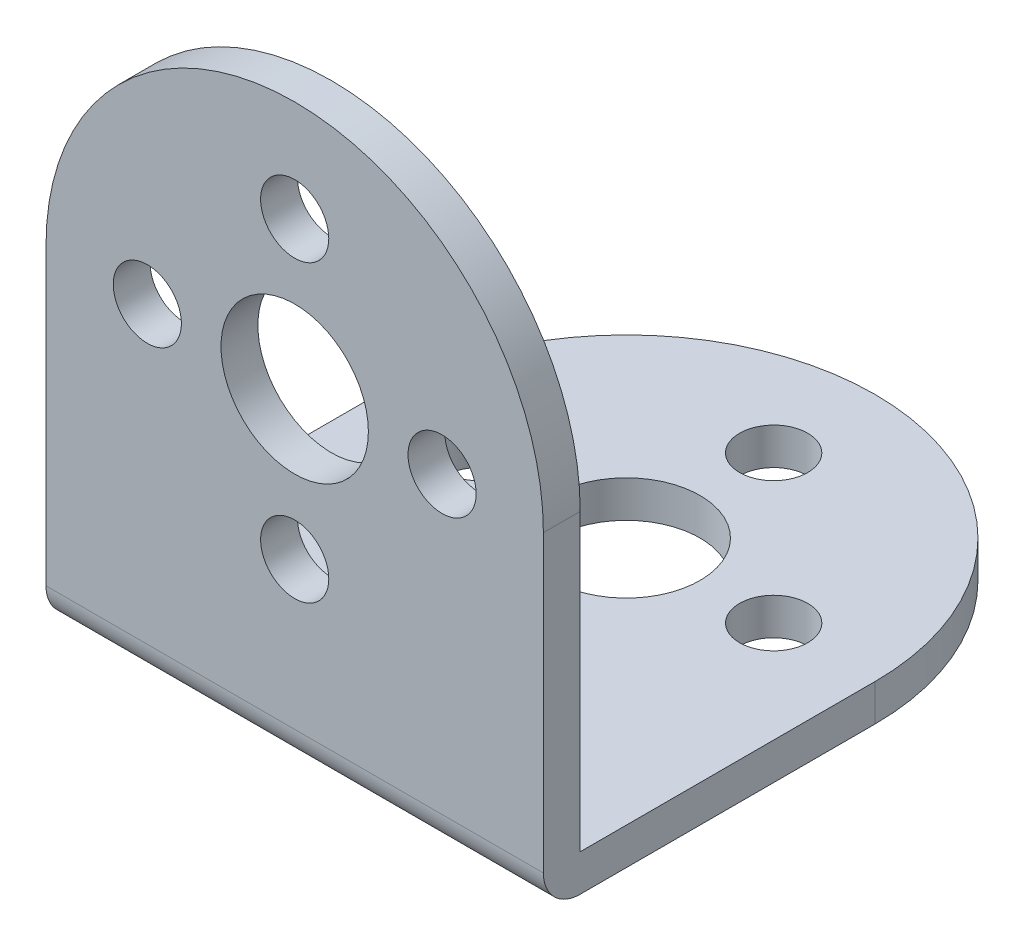
ISO-10303-21;
HEADER;
FILE_DESCRIPTION(('STEP AP214'),'2;1');
FILE_NAME('part.step','',(''),(''),'','','');
FILE_SCHEMA(('AUTOMOTIVE_DESIGN { 1 0 10303 214 1 1 1 1 }'));
ENDSEC;
DATA;
#1=APPLICATION_CONTEXT('core data for automotive mechanical design processes');
#2=APPLICATION_PROTOCOL_DEFINITION('international standard','automotive_design',2000,#1);
#3=PRODUCT_CONTEXT('',#1,'mechanical');
#4=PRODUCT('Part','Part','',(#3));
#5=PRODUCT_RELATED_PRODUCT_CATEGORY('part','',(#4));
#6=PRODUCT_DEFINITION_FORMATION('','',#4);
#7=PRODUCT_DEFINITION_CONTEXT('part definition',#1,'design');
#8=PRODUCT_DEFINITION('design','',#6,#7);
#9=PRODUCT_DEFINITION_SHAPE('','',#8);
#10=(LENGTH_UNIT() NAMED_UNIT(*) SI_UNIT(.MILLI.,.METRE.));
#11=(NAMED_UNIT(*) PLANE_ANGLE_UNIT() SI_UNIT($,.RADIAN.));
#12=(NAMED_UNIT(*) SI_UNIT($,.STERADIAN.) SOLID_ANGLE_UNIT());
#13=UNCERTAINTY_MEASURE_WITH_UNIT(LENGTH_MEASURE(1.E-05),#10,'distance_accuracy_value','');
#14=(GEOMETRIC_REPRESENTATION_CONTEXT(3) GLOBAL_UNCERTAINTY_ASSIGNED_CONTEXT((#13)) GLOBAL_UNIT_ASSIGNED_CONTEXT((#10,
#11,#12)) REPRESENTATION_CONTEXT('',''));
#15=CARTESIAN_POINT('',(0.,0.,0.));
#16=DIRECTION('',(0.,0.,1.));
#17=DIRECTION('',(1.,0.,0.));
#18=AXIS2_PLACEMENT_3D('',#15,#16,#17);
#19=CARTESIAN_POINT('',(0.,0.,-18.));
#20=DIRECTION('',(0.,1.,0.));
#21=DIRECTION('',(0.,0.,1.));
#22=AXIS2_PLACEMENT_3D('',#19,#20,#21);
#23=CYLINDRICAL_SURFACE('',#22,4.);
#24=CARTESIAN_POINT('',(0.,0.,-18.));
#25=DIRECTION('',(0.,1.,0.));
#26=DIRECTION('',(0.,0.,1.));
#27=AXIS2_PLACEMENT_3D('',#24,#25,#26);
#28=CIRCLE('',#27,4.);
#29=CARTESIAN_POINT('',(0.,0.,-14.));
#30=VERTEX_POINT('',#29);
#31=EDGE_CURVE('E185',#30,#30,#28,.T.);
#32=ORIENTED_EDGE('',*,*,#31,.F.);
#33=EDGE_LOOP('',(#32));
#34=FACE_BOUND('',#33,.T.);
#35=CARTESIAN_POINT('',(0.,2.,-18.));
#36=DIRECTION('',(0.,1.,0.));
#37=DIRECTION('',(0.,0.,1.));
#38=AXIS2_PLACEMENT_3D('',#35,#36,#37);
#39=CIRCLE('',#38,4.);
#40=CARTESIAN_POINT('',(0.,2.,-14.));
#41=VERTEX_POINT('',#40);
#42=EDGE_CURVE('E201',#41,#41,#39,.F.);
#43=ORIENTED_EDGE('',*,*,#42,.F.);
#44=EDGE_LOOP('',(#43));
#45=FACE_BOUND('',#44,.T.);
#46=ADVANCED_FACE('F15',(#34,#45),#23,.F.);
#47=CARTESIAN_POINT('',(0.,0.,-26.));
#48=DIRECTION('',(0.,1.,0.));
#49=DIRECTION('',(0.,0.,1.));
#50=AXIS2_PLACEMENT_3D('',#47,#48,#49);
#51=CYLINDRICAL_SURFACE('',#50,1.85);
#52=CARTESIAN_POINT('',(0.,0.,-26.));
#53=DIRECTION('',(0.,1.,0.));
#54=DIRECTION('',(0.,0.,1.));
#55=AXIS2_PLACEMENT_3D('',#52,#53,#54);
#56=CIRCLE('',#55,1.85);
#57=CARTESIAN_POINT('',(0.,0.,-24.15));
#58=VERTEX_POINT('',#57);
#59=EDGE_CURVE('E182',#58,#58,#56,.T.);
#60=ORIENTED_EDGE('',*,*,#59,.F.);
#61=EDGE_LOOP('',(#60));
#62=FACE_BOUND('',#61,.T.);
#63=CARTESIAN_POINT('',(0.,2.,-26.));
#64=DIRECTION('',(0.,1.,0.));
#65=DIRECTION('',(0.,0.,1.));
#66=AXIS2_PLACEMENT_3D('',#63,#64,#65);
#67=CIRCLE('',#66,1.85);
#68=CARTESIAN_POINT('',(0.,2.,-24.15));
#69=VERTEX_POINT('',#68);
#70=EDGE_CURVE('E199',#69,#69,#67,.F.);
#71=ORIENTED_EDGE('',*,*,#70,.F.);
#72=EDGE_LOOP('',(#71));
#73=FACE_BOUND('',#72,.T.);
#74=ADVANCED_FACE('F290',(#62,#73),#51,.F.);
#75=CARTESIAN_POINT('',(8.,0.,-18.));
#76=DIRECTION('',(0.,1.,0.));
#77=DIRECTION('',(0.,0.,1.));
#78=AXIS2_PLACEMENT_3D('',#75,#76,#77);
#79=CYLINDRICAL_SURFACE('',#78,1.85);
#80=CARTESIAN_POINT('',(8.,0.,-18.));
#81=DIRECTION('',(0.,1.,0.));
#82=DIRECTION('',(0.,0.,1.));
#83=AXIS2_PLACEMENT_3D('',#80,#81,#82);
#84=CIRCLE('',#83,1.85);
#85=CARTESIAN_POINT('',(8.,0.,-16.15));
#86=VERTEX_POINT('',#85);
#87=EDGE_CURVE('E179',#86,#86,#84,.T.);
#88=ORIENTED_EDGE('',*,*,#87,.F.);
#89=EDGE_LOOP('',(#88));
#90=FACE_BOUND('',#89,.T.);
#91=CARTESIAN_POINT('',(8.,2.,-18.));
#92=DIRECTION('',(0.,1.,0.));
#93=DIRECTION('',(0.,0.,1.));
#94=AXIS2_PLACEMENT_3D('',#91,#92,#93);
#95=CIRCLE('',#94,1.85);
#96=CARTESIAN_POINT('',(8.,2.,-16.15));
#97=VERTEX_POINT('',#96);
#98=EDGE_CURVE('E196',#97,#97,#95,.F.);
#99=ORIENTED_EDGE('',*,*,#98,.F.);
#100=EDGE_LOOP('',(#99));
#101=FACE_BOUND('',#100,.T.);
#102=ADVANCED_FACE('F287',(#90,#101),#79,.F.);
#103=CARTESIAN_POINT('',(0.,0.,-10.));
#104=DIRECTION('',(0.,1.,0.));
#105=DIRECTION('',(0.,0.,1.));
#106=AXIS2_PLACEMENT_3D('',#103,#104,#105);
#107=CYLINDRICAL_SURFACE('',#106,1.85);
#108=CARTESIAN_POINT('',(0.,0.,-10.));
#109=DIRECTION('',(0.,1.,0.));
#110=DIRECTION('',(0.,0.,1.));
#111=AXIS2_PLACEMENT_3D('',#108,#109,#110);
#112=CIRCLE('',#111,1.85);
#113=CARTESIAN_POINT('',(0.,0.,-8.15));
#114=VERTEX_POINT('',#113);
#115=EDGE_CURVE('E176',#114,#114,#112,.T.);
#116=ORIENTED_EDGE('',*,*,#115,.F.);
#117=EDGE_LOOP('',(#116));
#118=FACE_BOUND('',#117,.T.);
#119=CARTESIAN_POINT('',(0.,2.,-10.));
#120=DIRECTION('',(0.,1.,0.));
#121=DIRECTION('',(0.,0.,1.));
#122=AXIS2_PLACEMENT_3D('',#119,#120,#121);
#123=CIRCLE('',#122,1.85);
#124=CARTESIAN_POINT('',(0.,2.,-8.15));
#125=VERTEX_POINT('',#124);
#126=EDGE_CURVE('E193',#125,#125,#123,.F.);
#127=ORIENTED_EDGE('',*,*,#126,.F.);
#128=EDGE_LOOP('',(#127));
#129=FACE_BOUND('',#128,.T.);
#130=ADVANCED_FACE('F283',(#118,#129),#107,.F.);
#131=CARTESIAN_POINT('',(-8.,0.,-18.));
#132=DIRECTION('',(0.,1.,0.));
#133=DIRECTION('',(0.,0.,1.));
#134=AXIS2_PLACEMENT_3D('',#131,#132,#133);
#135=CYLINDRICAL_SURFACE('',#134,1.85);
#136=CARTESIAN_POINT('',(-8.,0.,-18.));
#137=DIRECTION('',(0.,1.,0.));
#138=DIRECTION('',(0.,0.,1.));
#139=AXIS2_PLACEMENT_3D('',#136,#137,#138);
#140=CIRCLE('',#139,1.85);
#141=CARTESIAN_POINT('',(-8.,0.,-16.15));
#142=VERTEX_POINT('',#141);
#143=EDGE_CURVE('E134',#142,#142,#140,.T.);
#144=ORIENTED_EDGE('',*,*,#143,.F.);
#145=EDGE_LOOP('',(#144));
#146=FACE_BOUND('',#145,.T.);
#147=CARTESIAN_POINT('',(-8.,2.,-18.));
#148=DIRECTION('',(0.,1.,0.));
#149=DIRECTION('',(0.,0.,1.));
#150=AXIS2_PLACEMENT_3D('',#147,#148,#149);
#151=CIRCLE('',#150,1.85);
#152=CARTESIAN_POINT('',(-8.,2.,-16.15));
#153=VERTEX_POINT('',#152);
#154=EDGE_CURVE('E190',#153,#153,#151,.F.);
#155=ORIENTED_EDGE('',*,*,#154,.F.);
#156=EDGE_LOOP('',(#155));
#157=FACE_BOUND('',#156,.T.);
#158=ADVANCED_FACE('F280',(#146,#157),#135,.F.);
#159=CARTESIAN_POINT('',(0.,-41.0634,-18.));
#160=DIRECTION('',(0.,1.,0.));
#161=DIRECTION('',(0.,0.,1.));
#162=AXIS2_PLACEMENT_3D('',#159,#160,#161);
#163=CYLINDRICAL_SURFACE('',#162,13.5);
#164=DIRECTION('',(0.,1.,0.));
#165=VECTOR('',#164,1.);
#166=CARTESIAN_POINT('',(-13.5,0.,-18.));
#167=LINE('',#166,#165);
#168=CARTESIAN_POINT('',(-13.5,0.,-18.));
#169=VERTEX_POINT('',#168);
#170=CARTESIAN_POINT('',(-13.5,2.,-18.));
#171=VERTEX_POINT('',#170);
#172=EDGE_CURVE('E116',#169,#171,#167,.T.);
#173=ORIENTED_EDGE('',*,*,#172,.T.);
#174=CARTESIAN_POINT('',(0.,2.,-18.));
#175=DIRECTION('',(0.,1.,0.));
#176=DIRECTION('',(0.,0.,1.));
#177=AXIS2_PLACEMENT_3D('',#174,#175,#176);
#178=CIRCLE('',#177,13.5);
#179=CARTESIAN_POINT('',(13.5,2.,-18.));
#180=VERTEX_POINT('',#179);
#181=EDGE_CURVE('E18',#180,#171,#178,.T.);
#182=ORIENTED_EDGE('',*,*,#181,.F.);
#183=DIRECTION('',(0.,1.,0.));
#184=VECTOR('',#183,1.);
#185=CARTESIAN_POINT('',(13.5,0.,-18.));
#186=LINE('',#185,#184);
#187=CARTESIAN_POINT('',(13.5,0.,-18.));
#188=VERTEX_POINT('',#187);
#189=EDGE_CURVE('E125',#188,#180,#186,.T.);
#190=ORIENTED_EDGE('',*,*,#189,.F.);
#191=CARTESIAN_POINT('',(0.,0.,-18.));
#192=DIRECTION('',(0.,1.,0.));
#193=DIRECTION('',(0.,0.,1.));
#194=AXIS2_PLACEMENT_3D('',#191,#192,#193);
#195=CIRCLE('',#194,13.5);
#196=EDGE_CURVE('E188',#169,#188,#195,.F.);
#197=ORIENTED_EDGE('',*,*,#196,.F.);
#198=EDGE_LOOP('',(#173,#182,#190,#197));
#199=FACE_BOUND('',#198,.T.);
#200=ADVANCED_FACE('F212',(#199),#163,.T.);
#201=CARTESIAN_POINT('',(-13.5,2.,-31.5));
#202=DIRECTION('',(0.,1.,0.));
#203=DIRECTION('',(0.,0.,1.));
#204=AXIS2_PLACEMENT_3D('',#201,#202,#203);
#205=PLANE('',#204);
#206=ORIENTED_EDGE('',*,*,#154,.T.);
#207=EDGE_LOOP('',(#206));
#208=FACE_BOUND('',#207,.T.);
#209=ORIENTED_EDGE('',*,*,#126,.T.);
#210=EDGE_LOOP('',(#209));
#211=FACE_BOUND('',#210,.T.);
#212=ORIENTED_EDGE('',*,*,#98,.T.);
#213=EDGE_LOOP('',(#212));
#214=FACE_BOUND('',#213,.T.);
#215=ORIENTED_EDGE('',*,*,#70,.T.);
#216=EDGE_LOOP('',(#215));
#217=FACE_BOUND('',#216,.T.);
#218=ORIENTED_EDGE('',*,*,#42,.T.);
#219=EDGE_LOOP('',(#218));
#220=FACE_BOUND('',#219,.T.);
#221=DIRECTION('',(0.,0.,-1.));
#222=VECTOR('',#221,1.);
#223=CARTESIAN_POINT('',(13.5,2.,0.));
#224=LINE('',#223,#222);
#225=CARTESIAN_POINT('',(13.5,2.,-2.));
#226=VERTEX_POINT('',#225);
#227=EDGE_CURVE('E142',#180,#226,#224,.F.);
#228=ORIENTED_EDGE('',*,*,#227,.F.);
#229=ORIENTED_EDGE('',*,*,#181,.T.);
#230=DIRECTION('',(0.,0.,-1.));
#231=VECTOR('',#230,1.);
#232=CARTESIAN_POINT('',(-13.5,2.,0.));
#233=LINE('',#232,#231);
#234=CARTESIAN_POINT('',(-13.5,2.,-2.));
#235=VERTEX_POINT('',#234);
#236=EDGE_CURVE('E130',#171,#235,#233,.F.);
#237=ORIENTED_EDGE('',*,*,#236,.T.);
#238=DIRECTION('',(-1.,0.,0.));
#239=VECTOR('',#238,1.);
#240=CARTESIAN_POINT('',(-13.5,2.,-2.));
#241=LINE('',#240,#239);
#242=EDGE_CURVE('E74',#226,#235,#241,.T.);
#243=ORIENTED_EDGE('',*,*,#242,.F.);
#244=EDGE_LOOP('',(#228,#229,#237,#243));
#245=FACE_BOUND('',#244,.T.);
#246=ADVANCED_FACE('F206',(#208,#211,#214,#217,#220,#245),#205,.T.);
#247=CARTESIAN_POINT('',(-13.5,0.,0.));
#248=DIRECTION('',(0.,-1.,0.));
#249=DIRECTION('',(0.,0.,-1.));
#250=AXIS2_PLACEMENT_3D('',#247,#248,#249);
#251=PLANE('',#250);
#252=ORIENTED_EDGE('',*,*,#143,.T.);
#253=EDGE_LOOP('',(#252));
#254=FACE_BOUND('',#253,.T.);
#255=ORIENTED_EDGE('',*,*,#115,.T.);
#256=EDGE_LOOP('',(#255));
#257=FACE_BOUND('',#256,.T.);
#258=ORIENTED_EDGE('',*,*,#87,.T.);
#259=EDGE_LOOP('',(#258));
#260=FACE_BOUND('',#259,.T.);
#261=ORIENTED_EDGE('',*,*,#59,.T.);
#262=EDGE_LOOP('',(#261));
#263=FACE_BOUND('',#262,.T.);
#264=ORIENTED_EDGE('',*,*,#31,.T.);
#265=EDGE_LOOP('',(#264));
#266=FACE_BOUND('',#265,.T.);
#267=DIRECTION('',(0.,0.,-1.));
#268=VECTOR('',#267,1.);
#269=CARTESIAN_POINT('',(13.5,0.,0.));
#270=LINE('',#269,#268);
#271=CARTESIAN_POINT('',(13.5,0.,-2.));
#272=VERTEX_POINT('',#271);
#273=EDGE_CURVE('E122',#272,#188,#270,.T.);
#274=ORIENTED_EDGE('',*,*,#273,.F.);
#275=DIRECTION('',(-1.,0.,0.));
#276=VECTOR('',#275,1.);
#277=CARTESIAN_POINT('',(48.6972,0.,-2.));
#278=LINE('',#277,#276);
#279=CARTESIAN_POINT('',(-13.5,0.,-2.));
#280=VERTEX_POINT('',#279);
#281=EDGE_CURVE('E118',#280,#272,#278,.F.);
#282=ORIENTED_EDGE('',*,*,#281,.F.);
#283=DIRECTION('',(0.,0.,-1.));
#284=VECTOR('',#283,1.);
#285=CARTESIAN_POINT('',(-13.5,0.,0.));
#286=LINE('',#285,#284);
#287=EDGE_CURVE('E113',#280,#169,#286,.T.);
#288=ORIENTED_EDGE('',*,*,#287,.T.);
#289=ORIENTED_EDGE('',*,*,#196,.T.);
#290=EDGE_LOOP('',(#274,#282,#288,#289));
#291=FACE_BOUND('',#290,.T.);
#292=ADVANCED_FACE('F214',(#254,#257,#260,#263,#266,#291),#251,.T.);
#293=CARTESIAN_POINT('',(-13.5,2.,-2.));
#294=DIRECTION('',(0.,0.,-1.));
#295=DIRECTION('',(-1.,0.,0.));
#296=AXIS2_PLACEMENT_3D('',#293,#294,#295);
#297=PLANE('',#296);
#298=CARTESIAN_POINT('',(-8.,18.,-2.));
#299=DIRECTION('',(0.,0.,1.));
#300=DIRECTION('',(1.,0.,0.));
#301=AXIS2_PLACEMENT_3D('',#298,#299,#300);
#302=CIRCLE('',#301,1.85);
#303=CARTESIAN_POINT('',(-6.15,18.,-2.));
#304=VERTEX_POINT('',#303);
#305=EDGE_CURVE('E106',#304,#304,#302,.T.);
#306=ORIENTED_EDGE('',*,*,#305,.T.);
#307=EDGE_LOOP('',(#306));
#308=FACE_BOUND('',#307,.T.);
#309=CARTESIAN_POINT('',(0.,10.,-2.));
#310=DIRECTION('',(0.,0.,1.));
#311=DIRECTION('',(1.,0.,0.));
#312=AXIS2_PLACEMENT_3D('',#309,#310,#311);
#313=CIRCLE('',#312,1.85);
#314=CARTESIAN_POINT('',(1.85,10.,-2.));
#315=VERTEX_POINT('',#314);
#316=EDGE_CURVE('E109',#315,#315,#313,.T.);
#317=ORIENTED_EDGE('',*,*,#316,.T.);
#318=EDGE_LOOP('',(#317));
#319=FACE_BOUND('',#318,.T.);
#320=CARTESIAN_POINT('',(8.,18.,-2.));
#321=DIRECTION('',(0.,0.,1.));
#322=DIRECTION('',(1.,0.,0.));
#323=AXIS2_PLACEMENT_3D('',#320,#321,#322);
#324=CIRCLE('',#323,1.85);
#325=CARTESIAN_POINT('',(9.85,18.,-2.));
#326=VERTEX_POINT('',#325);
#327=EDGE_CURVE('E162',#326,#326,#324,.T.);
#328=ORIENTED_EDGE('',*,*,#327,.T.);
#329=EDGE_LOOP('',(#328));
#330=FACE_BOUND('',#329,.T.);
#331=CARTESIAN_POINT('',(0.,26.,-2.));
#332=DIRECTION('',(0.,0.,1.));
#333=DIRECTION('',(1.,0.,0.));
#334=AXIS2_PLACEMENT_3D('',#331,#332,#333);
#335=CIRCLE('',#334,1.85);
#336=CARTESIAN_POINT('',(1.85,26.,-2.));
#337=VERTEX_POINT('',#336);
#338=EDGE_CURVE('E165',#337,#337,#335,.T.);
#339=ORIENTED_EDGE('',*,*,#338,.T.);
#340=EDGE_LOOP('',(#339));
#341=FACE_BOUND('',#340,.T.);
#342=CARTESIAN_POINT('',(0.,18.,-2.));
#343=DIRECTION('',(0.,0.,1.));
#344=DIRECTION('',(1.,0.,0.));
#345=AXIS2_PLACEMENT_3D('',#342,#343,#344);
#346=CIRCLE('',#345,4.);
#347=CARTESIAN_POINT('',(4.,18.,-2.));
#348=VERTEX_POINT('',#347);
#349=EDGE_CURVE('E168',#348,#348,#346,.T.);
#350=ORIENTED_EDGE('',*,*,#349,.T.);
#351=EDGE_LOOP('',(#350));
#352=FACE_BOUND('',#351,.T.);
#353=DIRECTION('',(0.,1.,0.));
#354=VECTOR('',#353,1.);
#355=CARTESIAN_POINT('',(-13.5,0.,-2.));
#356=LINE('',#355,#354);
#357=CARTESIAN_POINT('',(-13.5,18.,-2.));
#358=VERTEX_POINT('',#357);
#359=EDGE_CURVE('E119',#235,#358,#356,.T.);
#360=ORIENTED_EDGE('',*,*,#359,.T.);
#361=CARTESIAN_POINT('',(0.,18.,-2.));
#362=DIRECTION('',(0.,0.,1.));
#363=DIRECTION('',(1.,0.,0.));
#364=AXIS2_PLACEMENT_3D('',#361,#362,#363);
#365=CIRCLE('',#364,13.5);
#366=CARTESIAN_POINT('',(13.5,18.,-2.));
#367=VERTEX_POINT('',#366);
#368=EDGE_CURVE('E92',#367,#358,#365,.T.);
#369=ORIENTED_EDGE('',*,*,#368,.F.);
#370=DIRECTION('',(0.,1.,0.));
#371=VECTOR('',#370,1.);
#372=CARTESIAN_POINT('',(13.5,0.,-2.));
#373=LINE('',#372,#371);
#374=EDGE_CURVE('E88',#226,#367,#373,.T.);
#375=ORIENTED_EDGE('',*,*,#374,.F.);
#376=ORIENTED_EDGE('',*,*,#242,.T.);
#377=EDGE_LOOP('',(#360,#369,#375,#376));
#378=FACE_BOUND('',#377,.T.);
#379=ADVANCED_FACE('F211',(#308,#319,#330,#341,#352,#378),#297,.T.);
#380=CARTESIAN_POINT('',(13.5,0.,0.));
#381=DIRECTION('',(1.,0.,0.));
#382=DIRECTION('',(0.,0.,-1.));
#383=AXIS2_PLACEMENT_3D('',#380,#381,#382);
#384=PLANE('',#383);
#385=DIRECTION('',(0.,1.,0.));
#386=VECTOR('',#385,1.);
#387=CARTESIAN_POINT('',(13.5,31.5,0.));
#388=LINE('',#387,#386);
#389=CARTESIAN_POINT('',(13.5,2.,0.));
#390=VERTEX_POINT('',#389);
#391=CARTESIAN_POINT('',(13.5,18.,0.));
#392=VERTEX_POINT('',#391);
#393=EDGE_CURVE('E85',#390,#392,#388,.T.);
#394=ORIENTED_EDGE('',*,*,#393,.F.);
#395=CARTESIAN_POINT('',(13.5,2.,-2.));
#396=DIRECTION('',(-1.,0.,0.));
#397=DIRECTION('',(0.,0.,1.));
#398=AXIS2_PLACEMENT_3D('',#395,#396,#397);
#399=CIRCLE('',#398,2.);
#400=EDGE_CURVE('E128',#272,#390,#399,.T.);
#401=ORIENTED_EDGE('',*,*,#400,.F.);
#402=ORIENTED_EDGE('',*,*,#273,.T.);
#403=ORIENTED_EDGE('',*,*,#189,.T.);
#404=ORIENTED_EDGE('',*,*,#227,.T.);
#405=ORIENTED_EDGE('',*,*,#374,.T.);
#406=DIRECTION('',(0.,0.,1.));
#407=VECTOR('',#406,1.);
#408=CARTESIAN_POINT('',(13.5,18.,-72.5634));
#409=LINE('',#408,#407);
#410=EDGE_CURVE('E80',#392,#367,#409,.F.);
#411=ORIENTED_EDGE('',*,*,#410,.F.);
#412=EDGE_LOOP('',(#394,#401,#402,#403,#404,#405,#411));
#413=FACE_BOUND('',#412,.T.);
#414=ADVANCED_FACE('F82',(#413),#384,.T.);
#415=CARTESIAN_POINT('',(0.,18.,-72.5634));
#416=DIRECTION('',(0.,0.,1.));
#417=DIRECTION('',(1.,0.,0.));
#418=AXIS2_PLACEMENT_3D('',#415,#416,#417);
#419=CYLINDRICAL_SURFACE('',#418,13.5);
#420=DIRECTION('',(0.,0.,-1.));
#421=VECTOR('',#420,1.);
#422=CARTESIAN_POINT('',(-13.5,18.,0.));
#423=LINE('',#422,#421);
#424=CARTESIAN_POINT('',(-13.5,18.,0.));
#425=VERTEX_POINT('',#424);
#426=EDGE_CURVE('E98',#358,#425,#423,.F.);
#427=ORIENTED_EDGE('',*,*,#426,.T.);
#428=CARTESIAN_POINT('',(0.,18.,0.));
#429=DIRECTION('',(0.,0.,1.));
#430=DIRECTION('',(1.,0.,0.));
#431=AXIS2_PLACEMENT_3D('',#428,#429,#430);
#432=CIRCLE('',#431,13.5);
#433=EDGE_CURVE('E95',#392,#425,#432,.T.);
#434=ORIENTED_EDGE('',*,*,#433,.F.);
#435=ORIENTED_EDGE('',*,*,#410,.T.);
#436=ORIENTED_EDGE('',*,*,#368,.T.);
#437=EDGE_LOOP('',(#427,#434,#435,#436));
#438=FACE_BOUND('',#437,.T.);
#439=ADVANCED_FACE('F96',(#438),#419,.T.);
#440=CARTESIAN_POINT('',(-13.5,0.,0.));
#441=DIRECTION('',(1.,0.,0.));
#442=DIRECTION('',(0.,0.,-1.));
#443=AXIS2_PLACEMENT_3D('',#440,#441,#442);
#444=PLANE('',#443);
#445=ORIENTED_EDGE('',*,*,#426,.F.);
#446=ORIENTED_EDGE('',*,*,#359,.F.);
#447=ORIENTED_EDGE('',*,*,#236,.F.);
#448=ORIENTED_EDGE('',*,*,#172,.F.);
#449=ORIENTED_EDGE('',*,*,#287,.F.);
#450=CARTESIAN_POINT('',(-13.5,2.,-2.));
#451=DIRECTION('',(-1.,0.,0.));
#452=DIRECTION('',(0.,0.,1.));
#453=AXIS2_PLACEMENT_3D('',#450,#451,#452);
#454=CIRCLE('',#453,2.);
#455=CARTESIAN_POINT('',(-13.5,2.,0.));
#456=VERTEX_POINT('',#455);
#457=EDGE_CURVE('E33',#456,#280,#454,.F.);
#458=ORIENTED_EDGE('',*,*,#457,.F.);
#459=DIRECTION('',(0.,1.,0.));
#460=VECTOR('',#459,1.);
#461=CARTESIAN_POINT('',(-13.5,31.5,0.));
#462=LINE('',#461,#460);
#463=EDGE_CURVE('E101',#425,#456,#462,.F.);
#464=ORIENTED_EDGE('',*,*,#463,.F.);
#465=EDGE_LOOP('',(#445,#446,#447,#448,#449,#458,#464));
#466=FACE_BOUND('',#465,.T.);
#467=ADVANCED_FACE('F209',(#466),#444,.F.);
#468=CARTESIAN_POINT('',(48.6972,2.,-2.));
#469=DIRECTION('',(-1.,0.,0.));
#470=DIRECTION('',(0.,0.,1.));
#471=AXIS2_PLACEMENT_3D('',#468,#469,#470);
#472=CYLINDRICAL_SURFACE('',#471,2.);
#473=DIRECTION('',(1.,0.,0.));
#474=VECTOR('',#473,1.);
#475=CARTESIAN_POINT('',(-13.5,2.,0.));
#476=LINE('',#475,#474);
#477=EDGE_CURVE('E105',#456,#390,#476,.T.);
#478=ORIENTED_EDGE('',*,*,#477,.F.);
#479=ORIENTED_EDGE('',*,*,#457,.T.);
#480=ORIENTED_EDGE('',*,*,#281,.T.);
#481=ORIENTED_EDGE('',*,*,#400,.T.);
#482=EDGE_LOOP('',(#478,#479,#480,#481));
#483=FACE_BOUND('',#482,.T.);
#484=ADVANCED_FACE('F216',(#483),#472,.T.);
#485=CARTESIAN_POINT('',(0.,18.,0.));
#486=DIRECTION('',(0.,0.,1.));
#487=DIRECTION('',(1.,0.,0.));
#488=AXIS2_PLACEMENT_3D('',#485,#486,#487);
#489=CYLINDRICAL_SURFACE('',#488,4.);
#490=ORIENTED_EDGE('',*,*,#349,.F.);
#491=EDGE_LOOP('',(#490));
#492=FACE_BOUND('',#491,.T.);
#493=CARTESIAN_POINT('',(0.,18.,0.));
#494=DIRECTION('',(0.,0.,1.));
#495=DIRECTION('',(1.,0.,0.));
#496=AXIS2_PLACEMENT_3D('',#493,#494,#495);
#497=CIRCLE('',#496,4.);
#498=CARTESIAN_POINT('',(4.,18.,0.));
#499=VERTEX_POINT('',#498);
#500=EDGE_CURVE('E120',#499,#499,#497,.F.);
#501=ORIENTED_EDGE('',*,*,#500,.F.);
#502=EDGE_LOOP('',(#501));
#503=FACE_BOUND('',#502,.T.);
#504=ADVANCED_FACE('F218',(#492,#503),#489,.F.);
#505=CARTESIAN_POINT('',(0.,26.,0.));
#506=DIRECTION('',(0.,0.,1.));
#507=DIRECTION('',(1.,0.,0.));
#508=AXIS2_PLACEMENT_3D('',#505,#506,#507);
#509=CYLINDRICAL_SURFACE('',#508,1.85);
#510=ORIENTED_EDGE('',*,*,#338,.F.);
#511=EDGE_LOOP('',(#510));
#512=FACE_BOUND('',#511,.T.);
#513=CARTESIAN_POINT('',(0.,26.,0.));
#514=DIRECTION('',(0.,0.,1.));
#515=DIRECTION('',(1.,0.,0.));
#516=AXIS2_PLACEMENT_3D('',#513,#514,#515);
#517=CIRCLE('',#516,1.85);
#518=CARTESIAN_POINT('',(1.85,26.,0.));
#519=VERTEX_POINT('',#518);
#520=EDGE_CURVE('E155',#519,#519,#517,.F.);
#521=ORIENTED_EDGE('',*,*,#520,.F.);
#522=EDGE_LOOP('',(#521));
#523=FACE_BOUND('',#522,.T.);
#524=ADVANCED_FACE('F225',(#512,#523),#509,.F.);
#525=CARTESIAN_POINT('',(8.,18.,0.));
#526=DIRECTION('',(0.,0.,1.));
#527=DIRECTION('',(1.,0.,0.));
#528=AXIS2_PLACEMENT_3D('',#525,#526,#527);
#529=CYLINDRICAL_SURFACE('',#528,1.85);
#530=ORIENTED_EDGE('',*,*,#327,.F.);
#531=EDGE_LOOP('',(#530));
#532=FACE_BOUND('',#531,.T.);
#533=CARTESIAN_POINT('',(8.,18.,0.));
#534=DIRECTION('',(0.,0.,1.));
#535=DIRECTION('',(1.,0.,0.));
#536=AXIS2_PLACEMENT_3D('',#533,#534,#535);
#537=CIRCLE('',#536,1.85);
#538=CARTESIAN_POINT('',(9.85,18.,0.));
#539=VERTEX_POINT('',#538);
#540=EDGE_CURVE('E152',#539,#539,#537,.F.);
#541=ORIENTED_EDGE('',*,*,#540,.F.);
#542=EDGE_LOOP('',(#541));
#543=FACE_BOUND('',#542,.T.);
#544=ADVANCED_FACE('F243',(#532,#543),#529,.F.);
#545=CARTESIAN_POINT('',(0.,10.,0.));
#546=DIRECTION('',(0.,0.,1.));
#547=DIRECTION('',(1.,0.,0.));
#548=AXIS2_PLACEMENT_3D('',#545,#546,#547);
#549=CYLINDRICAL_SURFACE('',#548,1.85);
#550=ORIENTED_EDGE('',*,*,#316,.F.);
#551=EDGE_LOOP('',(#550));
#552=FACE_BOUND('',#551,.T.);
#553=CARTESIAN_POINT('',(0.,10.,0.));
#554=DIRECTION('',(0.,0.,1.));
#555=DIRECTION('',(1.,0.,0.));
#556=AXIS2_PLACEMENT_3D('',#553,#554,#555);
#557=CIRCLE('',#556,1.85);
#558=CARTESIAN_POINT('',(1.85,10.,0.));
#559=VERTEX_POINT('',#558);
#560=EDGE_CURVE('E24',#559,#559,#557,.F.);
#561=ORIENTED_EDGE('',*,*,#560,.F.);
#562=EDGE_LOOP('',(#561));
#563=FACE_BOUND('',#562,.T.);
#564=ADVANCED_FACE('F236',(#552,#563),#549,.F.);
#565=CARTESIAN_POINT('',(-8.,18.,0.));
#566=DIRECTION('',(0.,0.,1.));
#567=DIRECTION('',(1.,0.,0.));
#568=AXIS2_PLACEMENT_3D('',#565,#566,#567);
#569=CYLINDRICAL_SURFACE('',#568,1.85);
#570=ORIENTED_EDGE('',*,*,#305,.F.);
#571=EDGE_LOOP('',(#570));
#572=FACE_BOUND('',#571,.T.);
#573=CARTESIAN_POINT('',(-8.,18.,0.));
#574=DIRECTION('',(0.,0.,1.));
#575=DIRECTION('',(1.,0.,0.));
#576=AXIS2_PLACEMENT_3D('',#573,#574,#575);
#577=CIRCLE('',#576,1.85);
#578=CARTESIAN_POINT('',(-6.15,18.,0.));
#579=VERTEX_POINT('',#578);
#580=EDGE_CURVE('E10',#579,#579,#577,.F.);
#581=ORIENTED_EDGE('',*,*,#580,.F.);
#582=EDGE_LOOP('',(#581));
#583=FACE_BOUND('',#582,.T.);
#584=ADVANCED_FACE('F230',(#572,#583),#569,.F.);
#585=CARTESIAN_POINT('',(-13.5,31.5,0.));
#586=DIRECTION('',(0.,0.,1.));
#587=DIRECTION('',(1.,0.,0.));
#588=AXIS2_PLACEMENT_3D('',#585,#586,#587);
#589=PLANE('',#588);
#590=ORIENTED_EDGE('',*,*,#580,.T.);
#591=EDGE_LOOP('',(#590));
#592=FACE_BOUND('',#591,.T.);
#593=ORIENTED_EDGE('',*,*,#560,.T.);
#594=EDGE_LOOP('',(#593));
#595=FACE_BOUND('',#594,.T.);
#596=ORIENTED_EDGE('',*,*,#540,.T.);
#597=EDGE_LOOP('',(#596));
#598=FACE_BOUND('',#597,.T.);
#599=ORIENTED_EDGE('',*,*,#520,.T.);
#600=EDGE_LOOP('',(#599));
#601=FACE_BOUND('',#600,.T.);
#602=ORIENTED_EDGE('',*,*,#500,.T.);
#603=EDGE_LOOP('',(#602));
#604=FACE_BOUND('',#603,.T.);
#605=ORIENTED_EDGE('',*,*,#463,.T.);
#606=ORIENTED_EDGE('',*,*,#477,.T.);
#607=ORIENTED_EDGE('',*,*,#393,.T.);
#608=ORIENTED_EDGE('',*,*,#433,.T.);
#609=EDGE_LOOP('',(#605,#606,#607,#608));
#610=FACE_BOUND('',#609,.T.);
#611=ADVANCED_FACE('F104',(#592,#595,#598,#601,#604,#610),#589,.T.);
#612=CLOSED_SHELL('',(#46,#74,#102,#130,#158,#200,#246,#292,#379,#414,#439,#467,#484,#504,#524,
#544,#564,#584,#611));
#613=MANIFOLD_SOLID_BREP('B1',#612);
#614=ADVANCED_BREP_SHAPE_REPRESENTATION('',(#18,#613),#14);
#615=SHAPE_DEFINITION_REPRESENTATION(#9,#614);
ENDSEC;
END-ISO-10303-21;
